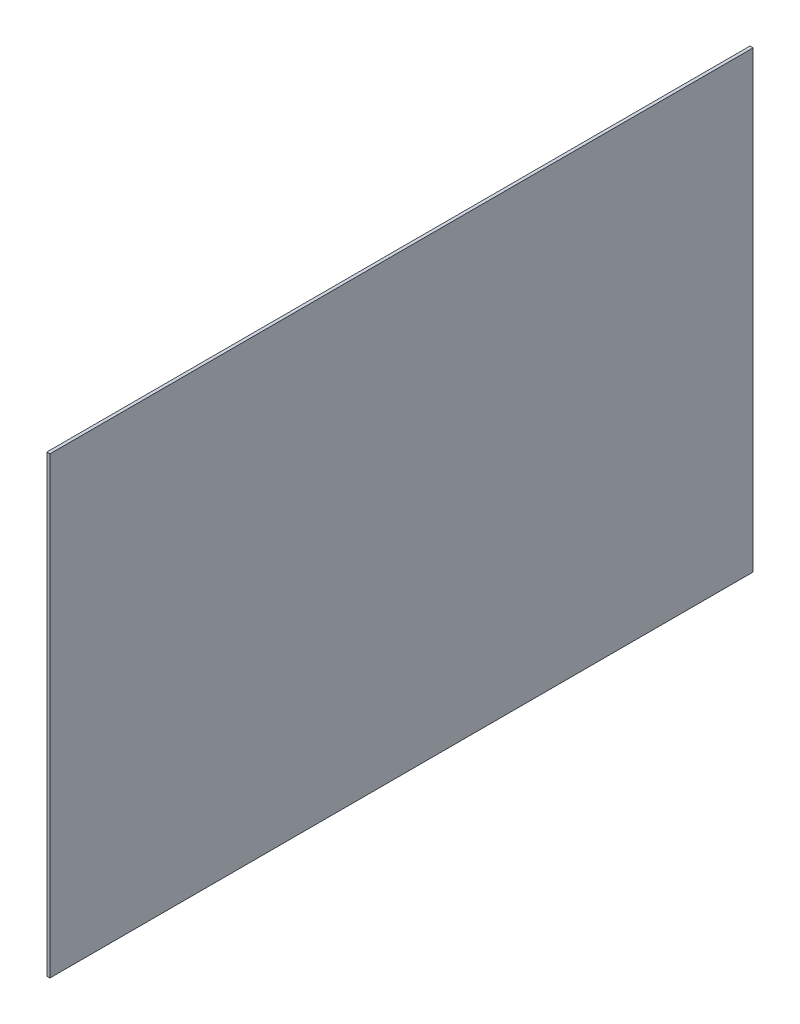
ISO-10303-21;
HEADER;
FILE_DESCRIPTION(('STEP AP214'),'2;1');
FILE_NAME('part.step','',(''),(''),'','','');
FILE_SCHEMA(('AUTOMOTIVE_DESIGN { 1 0 10303 214 1 1 1 1 }'));
ENDSEC;
DATA;
#1=APPLICATION_CONTEXT('core data for automotive mechanical design processes');
#2=APPLICATION_PROTOCOL_DEFINITION('international standard','automotive_design',2000,#1);
#3=PRODUCT_CONTEXT('',#1,'mechanical');
#4=PRODUCT('Part','Part','',(#3));
#5=PRODUCT_RELATED_PRODUCT_CATEGORY('part','',(#4));
#6=PRODUCT_DEFINITION_FORMATION('','',#4);
#7=PRODUCT_DEFINITION_CONTEXT('part definition',#1,'design');
#8=PRODUCT_DEFINITION('design','',#6,#7);
#9=PRODUCT_DEFINITION_SHAPE('','',#8);
#10=(LENGTH_UNIT() NAMED_UNIT(*) SI_UNIT(.MILLI.,.METRE.));
#11=(NAMED_UNIT(*) PLANE_ANGLE_UNIT() SI_UNIT($,.RADIAN.));
#12=(NAMED_UNIT(*) SI_UNIT($,.STERADIAN.) SOLID_ANGLE_UNIT());
#13=UNCERTAINTY_MEASURE_WITH_UNIT(LENGTH_MEASURE(1.E-05),#10,'distance_accuracy_value','');
#14=(GEOMETRIC_REPRESENTATION_CONTEXT(3) GLOBAL_UNCERTAINTY_ASSIGNED_CONTEXT((#13)) GLOBAL_UNIT_ASSIGNED_CONTEXT((#10,
#11,#12)) REPRESENTATION_CONTEXT('',''));
#15=CARTESIAN_POINT('',(0.,0.,0.));
#16=DIRECTION('',(0.,0.,1.));
#17=DIRECTION('',(1.,0.,0.));
#18=AXIS2_PLACEMENT_3D('',#15,#16,#17);
#19=CARTESIAN_POINT('',(4.,387.595671181981,109.35236206069));
#20=DIRECTION('',(0.,0.,-1.));
#21=DIRECTION('',(0.,1.,0.));
#22=AXIS2_PLACEMENT_3D('',#19,#20,#21);
#23=PLANE('',#22);
#24=DIRECTION('',(0.,-1.,0.));
#25=VECTOR('',#24,1.);
#26=CARTESIAN_POINT('',(0.,387.595671181981,109.35236206069));
#27=LINE('',#26,#25);
#28=CARTESIAN_POINT('',(0.,387.595671181981,109.35236206069));
#29=VERTEX_POINT('',#28);
#30=CARTESIAN_POINT('',(0.,-193.404328818019,109.35236206069));
#31=VERTEX_POINT('',#30);
#32=EDGE_CURVE('E98',#29,#31,#27,.T.);
#33=ORIENTED_EDGE('',*,*,#32,.T.);
#34=DIRECTION('',(-1.,0.,0.));
#35=VECTOR('',#34,1.);
#36=CARTESIAN_POINT('',(4.,-193.404328818019,109.35236206069));
#37=LINE('',#36,#35);
#38=CARTESIAN_POINT('',(4.,-193.404328818019,109.35236206069));
#39=VERTEX_POINT('',#38);
#40=EDGE_CURVE('E11',#39,#31,#37,.T.);
#41=ORIENTED_EDGE('',*,*,#40,.F.);
#42=DIRECTION('',(0.,-1.,0.));
#43=VECTOR('',#42,1.);
#44=CARTESIAN_POINT('',(4.,387.595671181981,109.35236206069));
#45=LINE('',#44,#43);
#46=CARTESIAN_POINT('',(4.,387.595671181981,109.35236206069));
#47=VERTEX_POINT('',#46);
#48=EDGE_CURVE('E86',#47,#39,#45,.T.);
#49=ORIENTED_EDGE('',*,*,#48,.F.);
#50=DIRECTION('',(-1.,0.,0.));
#51=VECTOR('',#50,1.);
#52=CARTESIAN_POINT('',(4.,387.595671181981,109.35236206069));
#53=LINE('',#52,#51);
#54=EDGE_CURVE('E94',#47,#29,#53,.T.);
#55=ORIENTED_EDGE('',*,*,#54,.T.);
#56=EDGE_LOOP('',(#33,#41,#49,#55));
#57=FACE_BOUND('',#56,.T.);
#58=ADVANCED_FACE('F35',(#57),#23,.F.);
#59=CARTESIAN_POINT('',(4.,-193.404328818019,109.35236206069));
#60=DIRECTION('',(0.,1.,0.));
#61=DIRECTION('',(0.,0.,1.));
#62=AXIS2_PLACEMENT_3D('',#59,#60,#61);
#63=PLANE('',#62);
#64=DIRECTION('',(0.,0.,-1.));
#65=VECTOR('',#64,1.);
#66=CARTESIAN_POINT('',(0.,-193.404328818019,109.35236206069));
#67=LINE('',#66,#65);
#68=CARTESIAN_POINT('',(0.,-193.404328818019,-790.64763793931));
#69=VERTEX_POINT('',#68);
#70=EDGE_CURVE('E90',#31,#69,#67,.T.);
#71=ORIENTED_EDGE('',*,*,#70,.T.);
#72=DIRECTION('',(-1.,0.,0.));
#73=VECTOR('',#72,1.);
#74=CARTESIAN_POINT('',(4.,-193.404328818019,-790.64763793931));
#75=LINE('',#74,#73);
#76=CARTESIAN_POINT('',(4.,-193.404328818019,-790.64763793931));
#77=VERTEX_POINT('',#76);
#78=EDGE_CURVE('E43',#77,#69,#75,.T.);
#79=ORIENTED_EDGE('',*,*,#78,.F.);
#80=DIRECTION('',(0.,0.,-1.));
#81=VECTOR('',#80,1.);
#82=CARTESIAN_POINT('',(4.,-193.404328818019,109.35236206069));
#83=LINE('',#82,#81);
#84=EDGE_CURVE('E81',#39,#77,#83,.T.);
#85=ORIENTED_EDGE('',*,*,#84,.F.);
#86=ORIENTED_EDGE('',*,*,#40,.T.);
#87=EDGE_LOOP('',(#71,#79,#85,#86));
#88=FACE_BOUND('',#87,.T.);
#89=ADVANCED_FACE('F89',(#88),#63,.F.);
#90=CARTESIAN_POINT('',(4.,387.595671181981,-790.64763793931));
#91=DIRECTION('',(0.,0.,1.));
#92=DIRECTION('',(0.,-1.,0.));
#93=AXIS2_PLACEMENT_3D('',#90,#91,#92);
#94=PLANE('',#93);
#95=DIRECTION('',(0.,1.,0.));
#96=VECTOR('',#95,1.);
#97=CARTESIAN_POINT('',(0.,387.595671181981,-790.64763793931));
#98=LINE('',#97,#96);
#99=CARTESIAN_POINT('',(0.,387.595671181981,-790.64763793931));
#100=VERTEX_POINT('',#99);
#101=EDGE_CURVE('E68',#69,#100,#98,.T.);
#102=ORIENTED_EDGE('',*,*,#101,.T.);
#103=DIRECTION('',(-1.,0.,0.));
#104=VECTOR('',#103,1.);
#105=CARTESIAN_POINT('',(4.,387.595671181981,-790.64763793931));
#106=LINE('',#105,#104);
#107=CARTESIAN_POINT('',(4.,387.595671181981,-790.64763793931));
#108=VERTEX_POINT('',#107);
#109=EDGE_CURVE('E91',#108,#100,#106,.T.);
#110=ORIENTED_EDGE('',*,*,#109,.F.);
#111=DIRECTION('',(0.,1.,0.));
#112=VECTOR('',#111,1.);
#113=CARTESIAN_POINT('',(4.,387.595671181981,-790.64763793931));
#114=LINE('',#113,#112);
#115=EDGE_CURVE('E84',#77,#108,#114,.T.);
#116=ORIENTED_EDGE('',*,*,#115,.F.);
#117=ORIENTED_EDGE('',*,*,#78,.T.);
#118=EDGE_LOOP('',(#102,#110,#116,#117));
#119=FACE_BOUND('',#118,.T.);
#120=ADVANCED_FACE('F92',(#119),#94,.F.);
#121=CARTESIAN_POINT('',(4.,387.595671181981,109.35236206069));
#122=DIRECTION('',(0.,-1.,0.));
#123=DIRECTION('',(0.,0.,-1.));
#124=AXIS2_PLACEMENT_3D('',#121,#122,#123);
#125=PLANE('',#124);
#126=DIRECTION('',(0.,0.,1.));
#127=VECTOR('',#126,1.);
#128=CARTESIAN_POINT('',(0.,387.595671181981,109.35236206069));
#129=LINE('',#128,#127);
#130=EDGE_CURVE('E74',#100,#29,#129,.T.);
#131=ORIENTED_EDGE('',*,*,#130,.T.);
#132=ORIENTED_EDGE('',*,*,#54,.F.);
#133=DIRECTION('',(0.,0.,1.));
#134=VECTOR('',#133,1.);
#135=CARTESIAN_POINT('',(4.,387.595671181981,109.35236206069));
#136=LINE('',#135,#134);
#137=EDGE_CURVE('E51',#108,#47,#136,.T.);
#138=ORIENTED_EDGE('',*,*,#137,.F.);
#139=ORIENTED_EDGE('',*,*,#109,.T.);
#140=EDGE_LOOP('',(#131,#132,#138,#139));
#141=FACE_BOUND('',#140,.T.);
#142=ADVANCED_FACE('F105',(#141),#125,.F.);
#143=CARTESIAN_POINT('',(4.,0.,0.));
#144=DIRECTION('',(1.,0.,0.));
#145=DIRECTION('',(0.,0.,-1.));
#146=AXIS2_PLACEMENT_3D('',#143,#144,#145);
#147=PLANE('',#146);
#148=ORIENTED_EDGE('',*,*,#48,.T.);
#149=ORIENTED_EDGE('',*,*,#84,.T.);
#150=ORIENTED_EDGE('',*,*,#115,.T.);
#151=ORIENTED_EDGE('',*,*,#137,.T.);
#152=EDGE_LOOP('',(#148,#149,#150,#151));
#153=FACE_BOUND('',#152,.T.);
#154=ADVANCED_FACE('F82',(#153),#147,.T.);
#155=CARTESIAN_POINT('',(0.,0.,0.));
#156=DIRECTION('',(1.,0.,0.));
#157=DIRECTION('',(0.,0.,-1.));
#158=AXIS2_PLACEMENT_3D('',#155,#156,#157);
#159=PLANE('',#158);
#160=ORIENTED_EDGE('',*,*,#32,.F.);
#161=ORIENTED_EDGE('',*,*,#130,.F.);
#162=ORIENTED_EDGE('',*,*,#101,.F.);
#163=ORIENTED_EDGE('',*,*,#70,.F.);
#164=EDGE_LOOP('',(#160,#161,#162,#163));
#165=FACE_BOUND('',#164,.T.);
#166=ADVANCED_FACE('F108',(#165),#159,.F.);
#167=CLOSED_SHELL('',(#58,#89,#120,#142,#154,#166));
#168=MANIFOLD_SOLID_BREP('B2',#167);
#169=ADVANCED_BREP_SHAPE_REPRESENTATION('',(#18,#168),#14);
#170=SHAPE_DEFINITION_REPRESENTATION(#9,#169);
ENDSEC;
END-ISO-10303-21;
